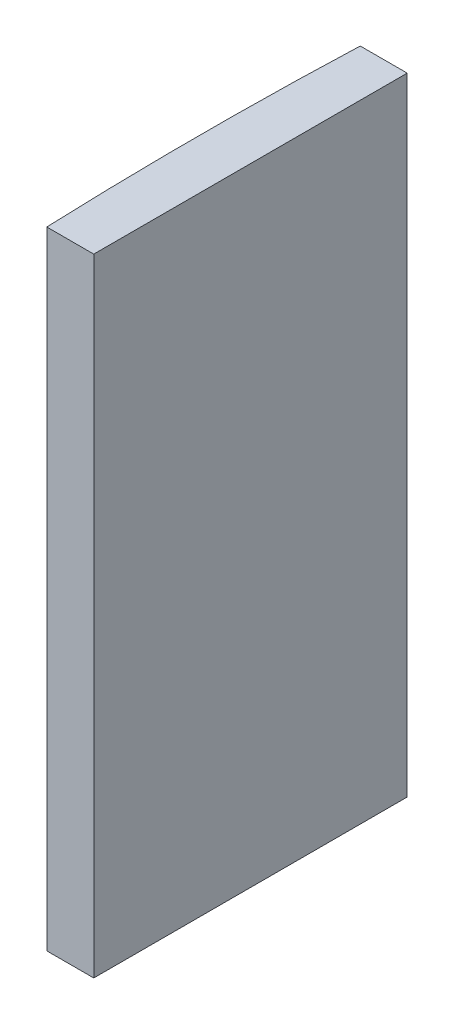
ISO-10303-21;
HEADER;
FILE_DESCRIPTION(('STEP AP214'),'2;1');
FILE_NAME('part.step','',(''),(''),'','','');
FILE_SCHEMA(('AUTOMOTIVE_DESIGN { 1 0 10303 214 1 1 1 1 }'));
ENDSEC;
DATA;
#1=APPLICATION_CONTEXT('core data for automotive mechanical design processes');
#2=APPLICATION_PROTOCOL_DEFINITION('international standard','automotive_design',2000,#1);
#3=PRODUCT_CONTEXT('',#1,'mechanical');
#4=PRODUCT('Part','Part','',(#3));
#5=PRODUCT_RELATED_PRODUCT_CATEGORY('part','',(#4));
#6=PRODUCT_DEFINITION_FORMATION('','',#4);
#7=PRODUCT_DEFINITION_CONTEXT('part definition',#1,'design');
#8=PRODUCT_DEFINITION('design','',#6,#7);
#9=PRODUCT_DEFINITION_SHAPE('','',#8);
#10=(LENGTH_UNIT() NAMED_UNIT(*) SI_UNIT(.MILLI.,.METRE.));
#11=(NAMED_UNIT(*) PLANE_ANGLE_UNIT() SI_UNIT($,.RADIAN.));
#12=(NAMED_UNIT(*) SI_UNIT($,.STERADIAN.) SOLID_ANGLE_UNIT());
#13=UNCERTAINTY_MEASURE_WITH_UNIT(LENGTH_MEASURE(1.E-05),#10,'distance_accuracy_value','');
#14=(GEOMETRIC_REPRESENTATION_CONTEXT(3) GLOBAL_UNCERTAINTY_ASSIGNED_CONTEXT((#13)) GLOBAL_UNIT_ASSIGNED_CONTEXT((#10,
#11,#12)) REPRESENTATION_CONTEXT('',''));
#15=CARTESIAN_POINT('',(0.,0.,0.));
#16=DIRECTION('',(0.,0.,1.));
#17=DIRECTION('',(1.,0.,0.));
#18=AXIS2_PLACEMENT_3D('',#15,#16,#17);
#19=CARTESIAN_POINT('',(4.35520433485127,40.,0.));
#20=DIRECTION('',(0.,-1.,0.));
#21=DIRECTION('',(0.,0.,-1.));
#22=AXIS2_PLACEMENT_3D('',#19,#20,#21);
#23=CYLINDRICAL_SURFACE('',#22,258.5);
#24=CARTESIAN_POINT('',(4.35520433485127,0.,0.));
#25=DIRECTION('',(0.,1.,0.));
#26=DIRECTION('',(0.,0.,1.));
#27=AXIS2_PLACEMENT_3D('',#24,#25,#26);
#28=CIRCLE('',#27,258.5);
#29=CARTESIAN_POINT('',(-253.951299648304,0.,-10.));
#30=VERTEX_POINT('',#29);
#31=CARTESIAN_POINT('',(-253.951299648304,0.,10.));
#32=VERTEX_POINT('',#31);
#33=EDGE_CURVE('E100',#30,#32,#28,.T.);
#34=ORIENTED_EDGE('',*,*,#33,.T.);
#35=DIRECTION('',(0.,-1.,0.));
#36=VECTOR('',#35,1.);
#37=CARTESIAN_POINT('',(-253.951299648304,40.,10.));
#38=LINE('',#37,#36);
#39=CARTESIAN_POINT('',(-253.951299648304,40.,10.));
#40=VERTEX_POINT('',#39);
#41=EDGE_CURVE('E11',#40,#32,#38,.T.);
#42=ORIENTED_EDGE('',*,*,#41,.F.);
#43=CARTESIAN_POINT('',(4.35520433485127,40.,0.));
#44=DIRECTION('',(0.,1.,0.));
#45=DIRECTION('',(0.,0.,1.));
#46=AXIS2_PLACEMENT_3D('',#43,#44,#45);
#47=CIRCLE('',#46,258.5);
#48=CARTESIAN_POINT('',(-253.951299648304,40.,-10.));
#49=VERTEX_POINT('',#48);
#50=EDGE_CURVE('E88',#49,#40,#47,.T.);
#51=ORIENTED_EDGE('',*,*,#50,.F.);
#52=DIRECTION('',(0.,-1.,0.));
#53=VECTOR('',#52,1.);
#54=CARTESIAN_POINT('',(-253.951299648304,40.,-10.));
#55=LINE('',#54,#53);
#56=EDGE_CURVE('E96',#49,#30,#55,.T.);
#57=ORIENTED_EDGE('',*,*,#56,.T.);
#58=EDGE_LOOP('',(#34,#42,#51,#57));
#59=FACE_BOUND('',#58,.T.);
#60=ADVANCED_FACE('F37',(#59),#23,.T.);
#61=CARTESIAN_POINT('',(-253.951299648304,40.,10.));
#62=DIRECTION('',(0.,0.,-1.));
#63=DIRECTION('',(-1.,0.,0.));
#64=AXIS2_PLACEMENT_3D('',#61,#62,#63);
#65=PLANE('',#64);
#66=DIRECTION('',(1.,0.,0.));
#67=VECTOR('',#66,1.);
#68=CARTESIAN_POINT('',(-253.951299648304,0.,10.));
#69=LINE('',#68,#67);
#70=CARTESIAN_POINT('',(-250.954795665149,0.,10.));
#71=VERTEX_POINT('',#70);
#72=EDGE_CURVE('E92',#32,#71,#69,.T.);
#73=ORIENTED_EDGE('',*,*,#72,.T.);
#74=DIRECTION('',(0.,-1.,0.));
#75=VECTOR('',#74,1.);
#76=CARTESIAN_POINT('',(-250.954795665149,40.,10.));
#77=LINE('',#76,#75);
#78=CARTESIAN_POINT('',(-250.954795665149,40.,10.));
#79=VERTEX_POINT('',#78);
#80=EDGE_CURVE('E45',#79,#71,#77,.T.);
#81=ORIENTED_EDGE('',*,*,#80,.F.);
#82=DIRECTION('',(1.,0.,0.));
#83=VECTOR('',#82,1.);
#84=CARTESIAN_POINT('',(-253.951299648304,40.,10.));
#85=LINE('',#84,#83);
#86=EDGE_CURVE('E83',#40,#79,#85,.T.);
#87=ORIENTED_EDGE('',*,*,#86,.F.);
#88=ORIENTED_EDGE('',*,*,#41,.T.);
#89=EDGE_LOOP('',(#73,#81,#87,#88));
#90=FACE_BOUND('',#89,.T.);
#91=ADVANCED_FACE('F91',(#90),#65,.F.);
#92=CARTESIAN_POINT('',(-250.954795665149,40.,-9.99999999999994));
#93=DIRECTION('',(-1.,0.,0.));
#94=DIRECTION('',(0.,0.,1.));
#95=AXIS2_PLACEMENT_3D('',#92,#93,#94);
#96=PLANE('',#95);
#97=DIRECTION('',(0.,0.,-1.));
#98=VECTOR('',#97,1.);
#99=CARTESIAN_POINT('',(-250.954795665149,0.,-9.99999999999994));
#100=LINE('',#99,#98);
#101=CARTESIAN_POINT('',(-250.954795665149,0.,-9.99999999999994));
#102=VERTEX_POINT('',#101);
#103=EDGE_CURVE('E70',#71,#102,#100,.T.);
#104=ORIENTED_EDGE('',*,*,#103,.T.);
#105=DIRECTION('',(0.,-1.,0.));
#106=VECTOR('',#105,1.);
#107=CARTESIAN_POINT('',(-250.954795665149,40.,-9.99999999999994));
#108=LINE('',#107,#106);
#109=CARTESIAN_POINT('',(-250.954795665149,40.,-9.99999999999994));
#110=VERTEX_POINT('',#109);
#111=EDGE_CURVE('E93',#110,#102,#108,.T.);
#112=ORIENTED_EDGE('',*,*,#111,.F.);
#113=DIRECTION('',(0.,0.,-1.));
#114=VECTOR('',#113,1.);
#115=CARTESIAN_POINT('',(-250.954795665149,40.,-9.99999999999994));
#116=LINE('',#115,#114);
#117=EDGE_CURVE('E86',#79,#110,#116,.T.);
#118=ORIENTED_EDGE('',*,*,#117,.F.);
#119=ORIENTED_EDGE('',*,*,#80,.T.);
#120=EDGE_LOOP('',(#104,#112,#118,#119));
#121=FACE_BOUND('',#120,.T.);
#122=ADVANCED_FACE('F94',(#121),#96,.F.);
#123=CARTESIAN_POINT('',(-253.951299648304,40.,-10.));
#124=DIRECTION('',(0.,0.,1.));
#125=DIRECTION('',(1.,0.,0.));
#126=AXIS2_PLACEMENT_3D('',#123,#124,#125);
#127=PLANE('',#126);
#128=DIRECTION('',(-1.,0.,0.));
#129=VECTOR('',#128,1.);
#130=CARTESIAN_POINT('',(-253.951299648304,0.,-10.));
#131=LINE('',#130,#129);
#132=EDGE_CURVE('E76',#102,#30,#131,.T.);
#133=ORIENTED_EDGE('',*,*,#132,.T.);
#134=ORIENTED_EDGE('',*,*,#56,.F.);
#135=DIRECTION('',(-1.,0.,0.));
#136=VECTOR('',#135,1.);
#137=CARTESIAN_POINT('',(-253.951299648304,40.,-10.));
#138=LINE('',#137,#136);
#139=EDGE_CURVE('E53',#110,#49,#138,.T.);
#140=ORIENTED_EDGE('',*,*,#139,.F.);
#141=ORIENTED_EDGE('',*,*,#111,.T.);
#142=EDGE_LOOP('',(#133,#134,#140,#141));
#143=FACE_BOUND('',#142,.T.);
#144=ADVANCED_FACE('F107',(#143),#127,.F.);
#145=CARTESIAN_POINT('',(4.35520433485127,40.,0.));
#146=DIRECTION('',(0.,1.,0.));
#147=DIRECTION('',(0.,0.,1.));
#148=AXIS2_PLACEMENT_3D('',#145,#146,#147);
#149=PLANE('',#148);
#150=ORIENTED_EDGE('',*,*,#50,.T.);
#151=ORIENTED_EDGE('',*,*,#86,.T.);
#152=ORIENTED_EDGE('',*,*,#117,.T.);
#153=ORIENTED_EDGE('',*,*,#139,.T.);
#154=EDGE_LOOP('',(#150,#151,#152,#153));
#155=FACE_BOUND('',#154,.T.);
#156=ADVANCED_FACE('F84',(#155),#149,.T.);
#157=CARTESIAN_POINT('',(4.35520433485127,0.,0.));
#158=DIRECTION('',(0.,1.,0.));
#159=DIRECTION('',(0.,0.,1.));
#160=AXIS2_PLACEMENT_3D('',#157,#158,#159);
#161=PLANE('',#160);
#162=ORIENTED_EDGE('',*,*,#33,.F.);
#163=ORIENTED_EDGE('',*,*,#132,.F.);
#164=ORIENTED_EDGE('',*,*,#103,.F.);
#165=ORIENTED_EDGE('',*,*,#72,.F.);
#166=EDGE_LOOP('',(#162,#163,#164,#165));
#167=FACE_BOUND('',#166,.T.);
#168=ADVANCED_FACE('F110',(#167),#161,.F.);
#169=CLOSED_SHELL('',(#60,#91,#122,#144,#156,#168));
#170=MANIFOLD_SOLID_BREP('B2',#169);
#171=ADVANCED_BREP_SHAPE_REPRESENTATION('',(#18,#170),#14);
#172=SHAPE_DEFINITION_REPRESENTATION(#9,#171);
ENDSEC;
END-ISO-10303-21;
